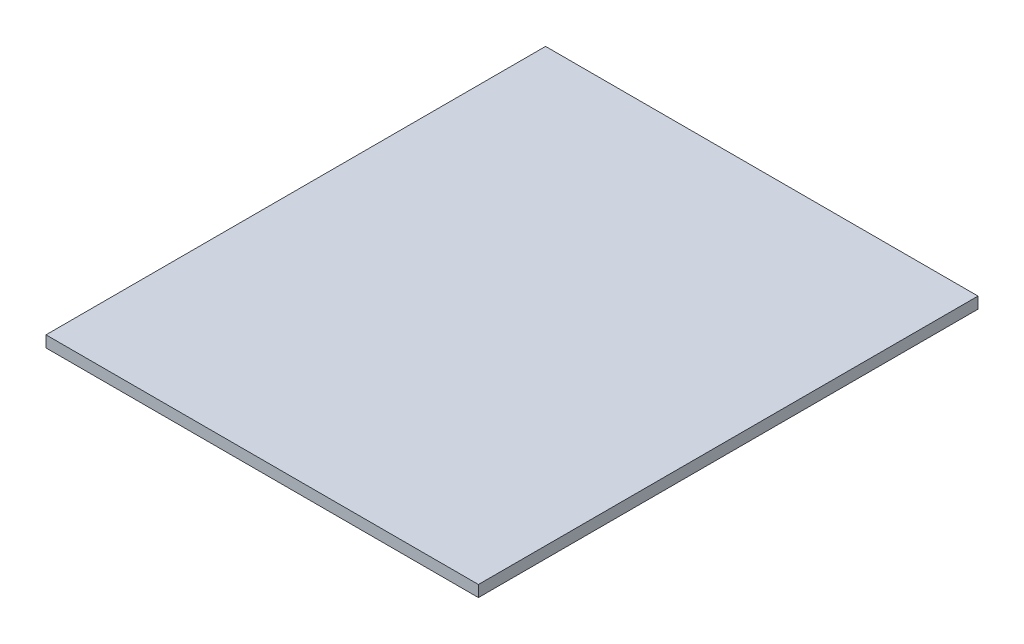
ISO-10303-21;
HEADER;
FILE_DESCRIPTION(('STEP AP214'),'2;1');
FILE_NAME('part.step','',(''),(''),'','','');
FILE_SCHEMA(('AUTOMOTIVE_DESIGN { 1 0 10303 214 1 1 1 1 }'));
ENDSEC;
DATA;
#1=APPLICATION_CONTEXT('core data for automotive mechanical design processes');
#2=APPLICATION_PROTOCOL_DEFINITION('international standard','automotive_design',2000,#1);
#3=PRODUCT_CONTEXT('',#1,'mechanical');
#4=PRODUCT('Part','Part','',(#3));
#5=PRODUCT_RELATED_PRODUCT_CATEGORY('part','',(#4));
#6=PRODUCT_DEFINITION_FORMATION('','',#4);
#7=PRODUCT_DEFINITION_CONTEXT('part definition',#1,'design');
#8=PRODUCT_DEFINITION('design','',#6,#7);
#9=PRODUCT_DEFINITION_SHAPE('','',#8);
#10=(LENGTH_UNIT() NAMED_UNIT(*) SI_UNIT(.MILLI.,.METRE.));
#11=(NAMED_UNIT(*) PLANE_ANGLE_UNIT() SI_UNIT($,.RADIAN.));
#12=(NAMED_UNIT(*) SI_UNIT($,.STERADIAN.) SOLID_ANGLE_UNIT());
#13=UNCERTAINTY_MEASURE_WITH_UNIT(LENGTH_MEASURE(1.E-05),#10,'distance_accuracy_value','');
#14=(GEOMETRIC_REPRESENTATION_CONTEXT(3) GLOBAL_UNCERTAINTY_ASSIGNED_CONTEXT((#13)) GLOBAL_UNIT_ASSIGNED_CONTEXT((#10,
#11,#12)) REPRESENTATION_CONTEXT('',''));
#15=CARTESIAN_POINT('',(0.,0.,0.));
#16=DIRECTION('',(0.,0.,1.));
#17=DIRECTION('',(1.,0.,0.));
#18=AXIS2_PLACEMENT_3D('',#15,#16,#17);
#19=CARTESIAN_POINT('',(190.,10.,219.5));
#20=DIRECTION('',(-1.,0.,0.));
#21=DIRECTION('',(0.,0.,1.));
#22=AXIS2_PLACEMENT_3D('',#19,#20,#21);
#23=PLANE('',#22);
#24=DIRECTION('',(0.,0.,-1.));
#25=VECTOR('',#24,1.);
#26=CARTESIAN_POINT('',(190.,0.,219.5));
#27=LINE('',#26,#25);
#28=CARTESIAN_POINT('',(190.,0.,219.5));
#29=VERTEX_POINT('',#28);
#30=CARTESIAN_POINT('',(190.,0.,-219.5));
#31=VERTEX_POINT('',#30);
#32=EDGE_CURVE('E107',#29,#31,#27,.T.);
#33=ORIENTED_EDGE('',*,*,#32,.T.);
#34=DIRECTION('',(0.,-1.,0.));
#35=VECTOR('',#34,1.);
#36=CARTESIAN_POINT('',(190.,10.,-219.5));
#37=LINE('',#36,#35);
#38=CARTESIAN_POINT('',(190.,10.,-219.5));
#39=VERTEX_POINT('',#38);
#40=EDGE_CURVE('E11',#39,#31,#37,.T.);
#41=ORIENTED_EDGE('',*,*,#40,.F.);
#42=DIRECTION('',(0.,0.,-1.));
#43=VECTOR('',#42,1.);
#44=CARTESIAN_POINT('',(190.,10.,219.5));
#45=LINE('',#44,#43);
#46=CARTESIAN_POINT('',(190.,10.,219.5));
#47=VERTEX_POINT('',#46);
#48=EDGE_CURVE('E91',#47,#39,#45,.T.);
#49=ORIENTED_EDGE('',*,*,#48,.F.);
#50=DIRECTION('',(0.,-1.,0.));
#51=VECTOR('',#50,1.);
#52=CARTESIAN_POINT('',(190.,10.,219.5));
#53=LINE('',#52,#51);
#54=EDGE_CURVE('E103',#47,#29,#53,.T.);
#55=ORIENTED_EDGE('',*,*,#54,.T.);
#56=EDGE_LOOP('',(#33,#41,#49,#55));
#57=FACE_BOUND('',#56,.T.);
#58=ADVANCED_FACE('F39',(#57),#23,.F.);
#59=CARTESIAN_POINT('',(-190.,10.,-219.5));
#60=DIRECTION('',(0.,0.,1.));
#61=DIRECTION('',(1.,0.,0.));
#62=AXIS2_PLACEMENT_3D('',#59,#60,#61);
#63=PLANE('',#62);
#64=DIRECTION('',(-1.,0.,0.));
#65=VECTOR('',#64,1.);
#66=CARTESIAN_POINT('',(-190.,0.,-219.5));
#67=LINE('',#66,#65);
#68=CARTESIAN_POINT('',(-190.,0.,-219.5));
#69=VERTEX_POINT('',#68);
#70=EDGE_CURVE('E96',#31,#69,#67,.T.);
#71=ORIENTED_EDGE('',*,*,#70,.T.);
#72=DIRECTION('',(0.,-1.,0.));
#73=VECTOR('',#72,1.);
#74=CARTESIAN_POINT('',(-190.,10.,-219.5));
#75=LINE('',#74,#73);
#76=CARTESIAN_POINT('',(-190.,10.,-219.5));
#77=VERTEX_POINT('',#76);
#78=EDGE_CURVE('E48',#77,#69,#75,.T.);
#79=ORIENTED_EDGE('',*,*,#78,.F.);
#80=DIRECTION('',(-1.,0.,0.));
#81=VECTOR('',#80,1.);
#82=CARTESIAN_POINT('',(-190.,10.,-219.5));
#83=LINE('',#82,#81);
#84=EDGE_CURVE('E86',#39,#77,#83,.T.);
#85=ORIENTED_EDGE('',*,*,#84,.F.);
#86=ORIENTED_EDGE('',*,*,#40,.T.);
#87=EDGE_LOOP('',(#71,#79,#85,#86));
#88=FACE_BOUND('',#87,.T.);
#89=ADVANCED_FACE('F95',(#88),#63,.F.);
#90=CARTESIAN_POINT('',(-190.,10.,219.5));
#91=DIRECTION('',(1.,0.,0.));
#92=DIRECTION('',(0.,0.,-1.));
#93=AXIS2_PLACEMENT_3D('',#90,#91,#92);
#94=PLANE('',#93);
#95=DIRECTION('',(0.,0.,1.));
#96=VECTOR('',#95,1.);
#97=CARTESIAN_POINT('',(-190.,0.,219.5));
#98=LINE('',#97,#96);
#99=CARTESIAN_POINT('',(-190.,0.,219.5));
#100=VERTEX_POINT('',#99);
#101=EDGE_CURVE('E73',#69,#100,#98,.T.);
#102=ORIENTED_EDGE('',*,*,#101,.T.);
#103=DIRECTION('',(0.,-1.,0.));
#104=VECTOR('',#103,1.);
#105=CARTESIAN_POINT('',(-190.,10.,219.5));
#106=LINE('',#105,#104);
#107=CARTESIAN_POINT('',(-190.,10.,219.5));
#108=VERTEX_POINT('',#107);
#109=EDGE_CURVE('E98',#108,#100,#106,.T.);
#110=ORIENTED_EDGE('',*,*,#109,.F.);
#111=DIRECTION('',(0.,0.,1.));
#112=VECTOR('',#111,1.);
#113=CARTESIAN_POINT('',(-190.,10.,219.5));
#114=LINE('',#113,#112);
#115=EDGE_CURVE('E89',#77,#108,#114,.T.);
#116=ORIENTED_EDGE('',*,*,#115,.F.);
#117=ORIENTED_EDGE('',*,*,#78,.T.);
#118=EDGE_LOOP('',(#102,#110,#116,#117));
#119=FACE_BOUND('',#118,.T.);
#120=ADVANCED_FACE('F99',(#119),#94,.F.);
#121=CARTESIAN_POINT('',(-190.,10.,219.5));
#122=DIRECTION('',(0.,0.,-1.));
#123=DIRECTION('',(-1.,0.,0.));
#124=AXIS2_PLACEMENT_3D('',#121,#122,#123);
#125=PLANE('',#124);
#126=DIRECTION('',(1.,0.,0.));
#127=VECTOR('',#126,1.);
#128=CARTESIAN_POINT('',(-190.,0.,219.5));
#129=LINE('',#128,#127);
#130=EDGE_CURVE('E79',#100,#29,#129,.T.);
#131=ORIENTED_EDGE('',*,*,#130,.T.);
#132=ORIENTED_EDGE('',*,*,#54,.F.);
#133=DIRECTION('',(1.,0.,0.));
#134=VECTOR('',#133,1.);
#135=CARTESIAN_POINT('',(-190.,10.,219.5));
#136=LINE('',#135,#134);
#137=EDGE_CURVE('E56',#108,#47,#136,.T.);
#138=ORIENTED_EDGE('',*,*,#137,.F.);
#139=ORIENTED_EDGE('',*,*,#109,.T.);
#140=EDGE_LOOP('',(#131,#132,#138,#139));
#141=FACE_BOUND('',#140,.T.);
#142=ADVANCED_FACE('F120',(#141),#125,.F.);
#143=CARTESIAN_POINT('',(0.,10.,0.));
#144=DIRECTION('',(0.,-1.,0.));
#145=DIRECTION('',(0.,0.,-1.));
#146=AXIS2_PLACEMENT_3D('',#143,#144,#145);
#147=PLANE('',#146);
#148=ORIENTED_EDGE('',*,*,#48,.T.);
#149=ORIENTED_EDGE('',*,*,#84,.T.);
#150=ORIENTED_EDGE('',*,*,#115,.T.);
#151=ORIENTED_EDGE('',*,*,#137,.T.);
#152=EDGE_LOOP('',(#148,#149,#150,#151));
#153=FACE_BOUND('',#152,.T.);
#154=ADVANCED_FACE('F87',(#153),#147,.F.);
#155=CARTESIAN_POINT('',(0.,0.,0.));
#156=DIRECTION('',(0.,-1.,0.));
#157=DIRECTION('',(0.,0.,-1.));
#158=AXIS2_PLACEMENT_3D('',#155,#156,#157);
#159=PLANE('',#158);
#160=ORIENTED_EDGE('',*,*,#32,.F.);
#161=ORIENTED_EDGE('',*,*,#130,.F.);
#162=ORIENTED_EDGE('',*,*,#101,.F.);
#163=ORIENTED_EDGE('',*,*,#70,.F.);
#164=EDGE_LOOP('',(#160,#161,#162,#163));
#165=FACE_BOUND('',#164,.T.);
#166=ADVANCED_FACE('F123',(#165),#159,.T.);
#167=CLOSED_SHELL('',(#58,#89,#120,#142,#154,#166));
#168=MANIFOLD_SOLID_BREP('B2',#167);
#169=ADVANCED_BREP_SHAPE_REPRESENTATION('',(#18,#168),#14);
#170=SHAPE_DEFINITION_REPRESENTATION(#9,#169);
ENDSEC;
END-ISO-10303-21;
